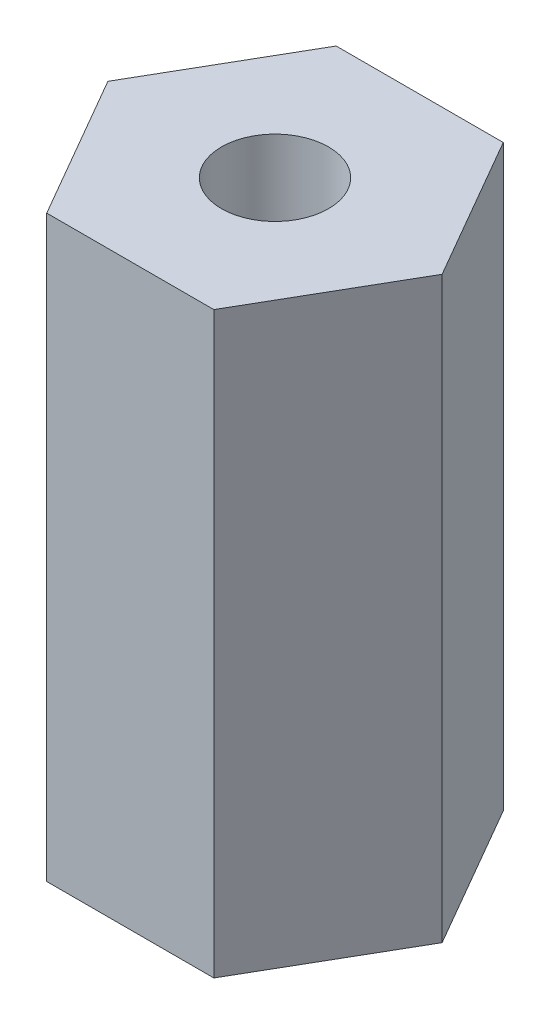
ISO-10303-21;
HEADER;
FILE_DESCRIPTION(('STEP AP214'),'2;1');
FILE_NAME('part.step','',(''),(''),'','','');
FILE_SCHEMA(('AUTOMOTIVE_DESIGN { 1 0 10303 214 1 1 1 1 }'));
ENDSEC;
DATA;
#1=APPLICATION_CONTEXT('core data for automotive mechanical design processes');
#2=APPLICATION_PROTOCOL_DEFINITION('international standard','automotive_design',2000,#1);
#3=PRODUCT_CONTEXT('',#1,'mechanical');
#4=PRODUCT('Part','Part','',(#3));
#5=PRODUCT_RELATED_PRODUCT_CATEGORY('part','',(#4));
#6=PRODUCT_DEFINITION_FORMATION('','',#4);
#7=PRODUCT_DEFINITION_CONTEXT('part definition',#1,'design');
#8=PRODUCT_DEFINITION('design','',#6,#7);
#9=PRODUCT_DEFINITION_SHAPE('','',#8);
#10=(LENGTH_UNIT() NAMED_UNIT(*) SI_UNIT(.MILLI.,.METRE.));
#11=(NAMED_UNIT(*) PLANE_ANGLE_UNIT() SI_UNIT($,.RADIAN.));
#12=(NAMED_UNIT(*) SI_UNIT($,.STERADIAN.) SOLID_ANGLE_UNIT());
#13=UNCERTAINTY_MEASURE_WITH_UNIT(LENGTH_MEASURE(1.E-05),#10,'distance_accuracy_value','');
#14=(GEOMETRIC_REPRESENTATION_CONTEXT(3) GLOBAL_UNCERTAINTY_ASSIGNED_CONTEXT((#13)) GLOBAL_UNIT_ASSIGNED_CONTEXT((#10,
#11,#12)) REPRESENTATION_CONTEXT('',''));
#15=CARTESIAN_POINT('',(0.,0.,0.));
#16=DIRECTION('',(0.,0.,1.));
#17=DIRECTION('',(1.,0.,0.));
#18=AXIS2_PLACEMENT_3D('',#15,#16,#17);
#19=CARTESIAN_POINT('',(7.33234841870824,50.8,12.7));
#20=DIRECTION('',(-0.866025403784438,0.,-0.5));
#21=DIRECTION('',(-0.5,0.,0.866025403784439));
#22=AXIS2_PLACEMENT_3D('',#19,#20,#21);
#23=PLANE('',#22);
#24=DIRECTION('',(0.5,0.,-0.866025403784438));
#25=VECTOR('',#24,1.);
#26=CARTESIAN_POINT('',(7.33234841870824,0.,12.7));
#27=LINE('',#26,#25);
#28=CARTESIAN_POINT('',(7.33234841870824,0.,12.7));
#29=VERTEX_POINT('',#28);
#30=CARTESIAN_POINT('',(14.6646968374165,0.,0.));
#31=VERTEX_POINT('',#30);
#32=EDGE_CURVE('E120',#29,#31,#27,.T.);
#33=ORIENTED_EDGE('',*,*,#32,.T.);
#34=DIRECTION('',(0.,-1.,0.));
#35=VECTOR('',#34,1.);
#36=CARTESIAN_POINT('',(14.6646968374165,50.8,0.));
#37=LINE('',#36,#35);
#38=CARTESIAN_POINT('',(14.6646968374165,50.8,0.));
#39=VERTEX_POINT('',#38);
#40=EDGE_CURVE('E11',#39,#31,#37,.T.);
#41=ORIENTED_EDGE('',*,*,#40,.F.);
#42=DIRECTION('',(0.5,0.,-0.866025403784438));
#43=VECTOR('',#42,1.);
#44=CARTESIAN_POINT('',(7.33234841870824,50.8,12.7));
#45=LINE('',#44,#43);
#46=CARTESIAN_POINT('',(7.33234841870824,50.8,12.7));
#47=VERTEX_POINT('',#46);
#48=EDGE_CURVE('E131',#47,#39,#45,.T.);
#49=ORIENTED_EDGE('',*,*,#48,.F.);
#50=DIRECTION('',(0.,-1.,0.));
#51=VECTOR('',#50,1.);
#52=CARTESIAN_POINT('',(7.33234841870824,50.8,12.7));
#53=LINE('',#52,#51);
#54=EDGE_CURVE('E116',#47,#29,#53,.T.);
#55=ORIENTED_EDGE('',*,*,#54,.T.);
#56=EDGE_LOOP('',(#33,#41,#49,#55));
#57=FACE_BOUND('',#56,.T.);
#58=ADVANCED_FACE('F36',(#57),#23,.F.);
#59=CARTESIAN_POINT('',(14.6646968374165,50.8,0.));
#60=DIRECTION('',(-0.866025403784439,0.,0.5));
#61=DIRECTION('',(0.5,0.,0.866025403784439));
#62=AXIS2_PLACEMENT_3D('',#59,#60,#61);
#63=PLANE('',#62);
#64=DIRECTION('',(-0.5,0.,-0.866025403784439));
#65=VECTOR('',#64,1.);
#66=CARTESIAN_POINT('',(14.6646968374165,0.,0.));
#67=LINE('',#66,#65);
#68=CARTESIAN_POINT('',(7.33234841870824,0.,-12.7));
#69=VERTEX_POINT('',#68);
#70=EDGE_CURVE('E123',#31,#69,#67,.T.);
#71=ORIENTED_EDGE('',*,*,#70,.T.);
#72=DIRECTION('',(0.,-1.,0.));
#73=VECTOR('',#72,1.);
#74=CARTESIAN_POINT('',(7.33234841870824,50.8,-12.7));
#75=LINE('',#74,#73);
#76=CARTESIAN_POINT('',(7.33234841870824,50.8,-12.7));
#77=VERTEX_POINT('',#76);
#78=EDGE_CURVE('E44',#77,#69,#75,.T.);
#79=ORIENTED_EDGE('',*,*,#78,.F.);
#80=DIRECTION('',(-0.5,0.,-0.866025403784439));
#81=VECTOR('',#80,1.);
#82=CARTESIAN_POINT('',(14.6646968374165,50.8,0.));
#83=LINE('',#82,#81);
#84=EDGE_CURVE('E89',#39,#77,#83,.T.);
#85=ORIENTED_EDGE('',*,*,#84,.F.);
#86=ORIENTED_EDGE('',*,*,#40,.T.);
#87=EDGE_LOOP('',(#71,#79,#85,#86));
#88=FACE_BOUND('',#87,.T.);
#89=ADVANCED_FACE('F156',(#88),#63,.F.);
#90=CARTESIAN_POINT('',(7.33234841870824,50.8,-12.7));
#91=DIRECTION('',(0.,0.,1.));
#92=DIRECTION('',(1.,0.,0.));
#93=AXIS2_PLACEMENT_3D('',#90,#91,#92);
#94=PLANE('',#93);
#95=DIRECTION('',(-1.,0.,0.));
#96=VECTOR('',#95,1.);
#97=CARTESIAN_POINT('',(7.33234841870824,0.,-12.7));
#98=LINE('',#97,#96);
#99=CARTESIAN_POINT('',(-7.33234841870824,0.,-12.7));
#100=VERTEX_POINT('',#99);
#101=EDGE_CURVE('E126',#69,#100,#98,.T.);
#102=ORIENTED_EDGE('',*,*,#101,.T.);
#103=DIRECTION('',(0.,-1.,0.));
#104=VECTOR('',#103,1.);
#105=CARTESIAN_POINT('',(-7.33234841870824,50.8,-12.7));
#106=LINE('',#105,#104);
#107=CARTESIAN_POINT('',(-7.33234841870824,50.8,-12.7));
#108=VERTEX_POINT('',#107);
#109=EDGE_CURVE('E111',#108,#100,#106,.T.);
#110=ORIENTED_EDGE('',*,*,#109,.F.);
#111=DIRECTION('',(-1.,0.,0.));
#112=VECTOR('',#111,1.);
#113=CARTESIAN_POINT('',(7.33234841870824,50.8,-12.7));
#114=LINE('',#113,#112);
#115=EDGE_CURVE('E102',#77,#108,#114,.T.);
#116=ORIENTED_EDGE('',*,*,#115,.F.);
#117=ORIENTED_EDGE('',*,*,#78,.T.);
#118=EDGE_LOOP('',(#102,#110,#116,#117));
#119=FACE_BOUND('',#118,.T.);
#120=ADVANCED_FACE('F137',(#119),#94,.F.);
#121=CARTESIAN_POINT('',(-7.33234841870824,50.8,-12.7));
#122=DIRECTION('',(0.866025403784439,0.,0.5));
#123=DIRECTION('',(0.5,0.,-0.866025403784439));
#124=AXIS2_PLACEMENT_3D('',#121,#122,#123);
#125=PLANE('',#124);
#126=DIRECTION('',(-0.5,0.,0.866025403784439));
#127=VECTOR('',#126,1.);
#128=CARTESIAN_POINT('',(-7.33234841870824,0.,-12.7));
#129=LINE('',#128,#127);
#130=CARTESIAN_POINT('',(-14.6646968374165,0.,0.));
#131=VERTEX_POINT('',#130);
#132=EDGE_CURVE('E110',#100,#131,#129,.T.);
#133=ORIENTED_EDGE('',*,*,#132,.T.);
#134=DIRECTION('',(0.,-1.,0.));
#135=VECTOR('',#134,1.);
#136=CARTESIAN_POINT('',(-14.6646968374165,50.8,0.));
#137=LINE('',#136,#135);
#138=CARTESIAN_POINT('',(-14.6646968374165,50.8,0.));
#139=VERTEX_POINT('',#138);
#140=EDGE_CURVE('E107',#139,#131,#137,.T.);
#141=ORIENTED_EDGE('',*,*,#140,.F.);
#142=DIRECTION('',(-0.5,0.,0.866025403784439));
#143=VECTOR('',#142,1.);
#144=CARTESIAN_POINT('',(-7.33234841870824,50.8,-12.7));
#145=LINE('',#144,#143);
#146=EDGE_CURVE('E96',#108,#139,#145,.T.);
#147=ORIENTED_EDGE('',*,*,#146,.F.);
#148=ORIENTED_EDGE('',*,*,#109,.T.);
#149=EDGE_LOOP('',(#133,#141,#147,#148));
#150=FACE_BOUND('',#149,.T.);
#151=ADVANCED_FACE('F108',(#150),#125,.F.);
#152=CARTESIAN_POINT('',(-14.6646968374165,50.8,0.));
#153=DIRECTION('',(0.866025403784439,0.,-0.5));
#154=DIRECTION('',(-0.5,0.,-0.866025403784439));
#155=AXIS2_PLACEMENT_3D('',#152,#153,#154);
#156=PLANE('',#155);
#157=DIRECTION('',(0.5,0.,0.866025403784439));
#158=VECTOR('',#157,1.);
#159=CARTESIAN_POINT('',(-14.6646968374165,0.,0.));
#160=LINE('',#159,#158);
#161=CARTESIAN_POINT('',(-7.33234841870824,0.,12.7));
#162=VERTEX_POINT('',#161);
#163=EDGE_CURVE('E75',#131,#162,#160,.T.);
#164=ORIENTED_EDGE('',*,*,#163,.T.);
#165=DIRECTION('',(0.,-1.,0.));
#166=VECTOR('',#165,1.);
#167=CARTESIAN_POINT('',(-7.33234841870824,50.8,12.7));
#168=LINE('',#167,#166);
#169=CARTESIAN_POINT('',(-7.33234841870824,50.8,12.7));
#170=VERTEX_POINT('',#169);
#171=EDGE_CURVE('E112',#170,#162,#168,.T.);
#172=ORIENTED_EDGE('',*,*,#171,.F.);
#173=DIRECTION('',(0.5,0.,0.866025403784439));
#174=VECTOR('',#173,1.);
#175=CARTESIAN_POINT('',(-14.6646968374165,50.8,0.));
#176=LINE('',#175,#174);
#177=EDGE_CURVE('E100',#139,#170,#176,.T.);
#178=ORIENTED_EDGE('',*,*,#177,.F.);
#179=ORIENTED_EDGE('',*,*,#140,.T.);
#180=EDGE_LOOP('',(#164,#172,#178,#179));
#181=FACE_BOUND('',#180,.T.);
#182=ADVANCED_FACE('F114',(#181),#156,.F.);
#183=CARTESIAN_POINT('',(-7.33234841870824,50.8,12.7));
#184=DIRECTION('',(0.,0.,-1.));
#185=DIRECTION('',(-1.,0.,0.));
#186=AXIS2_PLACEMENT_3D('',#183,#184,#185);
#187=PLANE('',#186);
#188=DIRECTION('',(1.,0.,0.));
#189=VECTOR('',#188,1.);
#190=CARTESIAN_POINT('',(-7.33234841870824,0.,12.7));
#191=LINE('',#190,#189);
#192=EDGE_CURVE('E81',#162,#29,#191,.T.);
#193=ORIENTED_EDGE('',*,*,#192,.T.);
#194=ORIENTED_EDGE('',*,*,#54,.F.);
#195=DIRECTION('',(1.,0.,0.));
#196=VECTOR('',#195,1.);
#197=CARTESIAN_POINT('',(-7.33234841870824,50.8,12.7));
#198=LINE('',#197,#196);
#199=EDGE_CURVE('E52',#170,#47,#198,.T.);
#200=ORIENTED_EDGE('',*,*,#199,.F.);
#201=ORIENTED_EDGE('',*,*,#171,.T.);
#202=EDGE_LOOP('',(#193,#194,#200,#201));
#203=FACE_BOUND('',#202,.T.);
#204=ADVANCED_FACE('F144',(#203),#187,.F.);
#205=CARTESIAN_POINT('',(0.,50.8,0.));
#206=DIRECTION('',(0.,1.,0.));
#207=DIRECTION('',(0.,0.,1.));
#208=AXIS2_PLACEMENT_3D('',#205,#206,#207);
#209=PLANE('',#208);
#210=CARTESIAN_POINT('',(0.,50.8,0.));
#211=DIRECTION('',(0.,1.,0.));
#212=DIRECTION('',(0.,0.,1.));
#213=AXIS2_PLACEMENT_3D('',#210,#211,#212);
#214=CIRCLE('',#213,4.699);
#215=CARTESIAN_POINT('',(0.,50.8,4.699));
#216=VERTEX_POINT('',#215);
#217=EDGE_CURVE('E124',#216,#216,#214,.F.);
#218=ORIENTED_EDGE('',*,*,#217,.T.);
#219=EDGE_LOOP('',(#218));
#220=FACE_BOUND('',#219,.T.);
#221=ORIENTED_EDGE('',*,*,#48,.T.);
#222=ORIENTED_EDGE('',*,*,#84,.T.);
#223=ORIENTED_EDGE('',*,*,#115,.T.);
#224=ORIENTED_EDGE('',*,*,#146,.T.);
#225=ORIENTED_EDGE('',*,*,#177,.T.);
#226=ORIENTED_EDGE('',*,*,#199,.T.);
#227=EDGE_LOOP('',(#221,#222,#223,#224,#225,#226));
#228=FACE_BOUND('',#227,.T.);
#229=ADVANCED_FACE('F98',(#220,#228),#209,.T.);
#230=CARTESIAN_POINT('',(0.,0.,0.));
#231=DIRECTION('',(0.,1.,0.));
#232=DIRECTION('',(0.,0.,1.));
#233=AXIS2_PLACEMENT_3D('',#230,#231,#232);
#234=PLANE('',#233);
#235=CARTESIAN_POINT('',(0.,0.,0.));
#236=DIRECTION('',(0.,-1.,0.));
#237=DIRECTION('',(0.,0.,-1.));
#238=AXIS2_PLACEMENT_3D('',#235,#236,#237);
#239=CIRCLE('',#238,4.699);
#240=CARTESIAN_POINT('',(0.,0.,-4.699));
#241=VERTEX_POINT('',#240);
#242=EDGE_CURVE('E209',#241,#241,#239,.T.);
#243=ORIENTED_EDGE('',*,*,#242,.F.);
#244=EDGE_LOOP('',(#243));
#245=FACE_BOUND('',#244,.T.);
#246=ORIENTED_EDGE('',*,*,#32,.F.);
#247=ORIENTED_EDGE('',*,*,#192,.F.);
#248=ORIENTED_EDGE('',*,*,#163,.F.);
#249=ORIENTED_EDGE('',*,*,#132,.F.);
#250=ORIENTED_EDGE('',*,*,#101,.F.);
#251=ORIENTED_EDGE('',*,*,#70,.F.);
#252=EDGE_LOOP('',(#246,#247,#248,#249,#250,#251));
#253=FACE_BOUND('',#252,.T.);
#254=ADVANCED_FACE('F140',(#245,#253),#234,.F.);
#255=CARTESIAN_POINT('',(0.,64.0907790591823,0.));
#256=DIRECTION('',(0.,-1.,0.));
#257=DIRECTION('',(0.,0.,-1.));
#258=AXIS2_PLACEMENT_3D('',#255,#256,#257);
#259=CYLINDRICAL_SURFACE('',#258,4.699);
#260=ORIENTED_EDGE('',*,*,#242,.T.);
#261=EDGE_LOOP('',(#260));
#262=FACE_BOUND('',#261,.T.);
#263=ORIENTED_EDGE('',*,*,#217,.F.);
#264=EDGE_LOOP('',(#263));
#265=FACE_BOUND('',#264,.T.);
#266=ADVANCED_FACE('F193',(#262,#265),#259,.F.);
#267=CLOSED_SHELL('',(#58,#89,#120,#151,#182,#204,#229,#254,#266));
#268=MANIFOLD_SOLID_BREP('B2',#267);
#269=ADVANCED_BREP_SHAPE_REPRESENTATION('',(#18,#268),#14);
#270=SHAPE_DEFINITION_REPRESENTATION(#9,#269);
ENDSEC;
END-ISO-10303-21;
